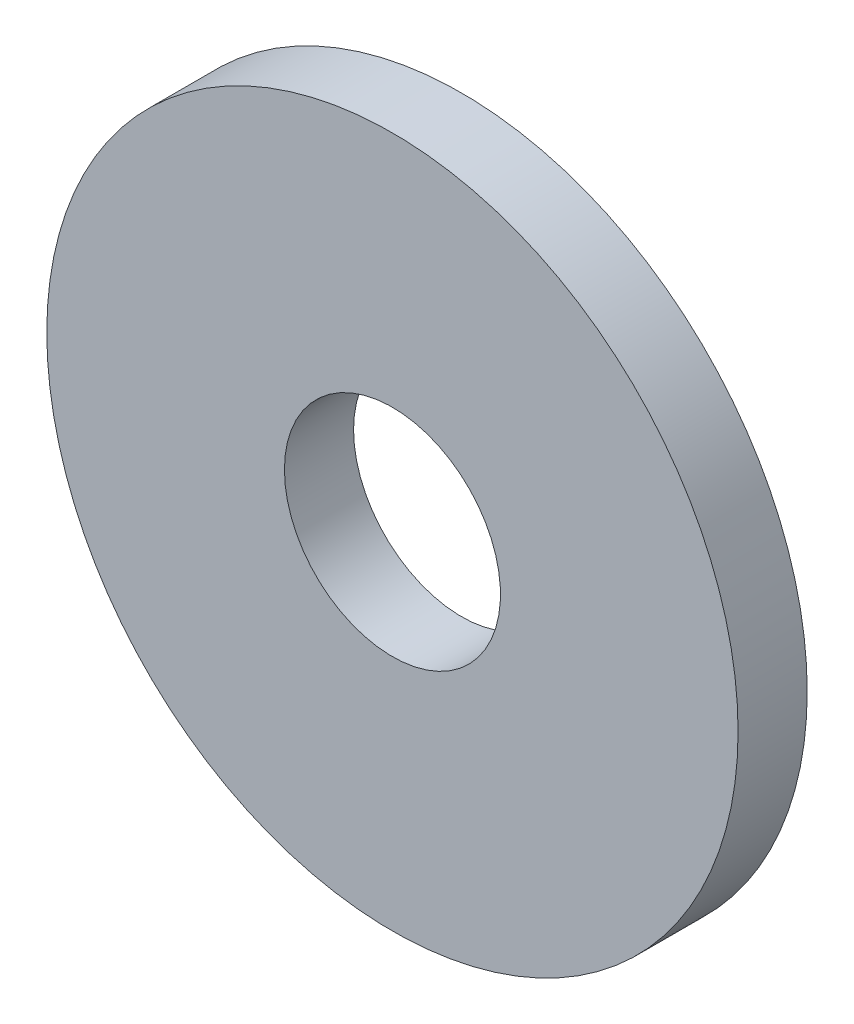
ISO-10303-21;
HEADER;
FILE_DESCRIPTION(('STEP AP214'),'2;1');
FILE_NAME('part.step','',(''),(''),'','','');
FILE_SCHEMA(('AUTOMOTIVE_DESIGN { 1 0 10303 214 1 1 1 1 }'));
ENDSEC;
DATA;
#1=APPLICATION_CONTEXT('core data for automotive mechanical design processes');
#2=APPLICATION_PROTOCOL_DEFINITION('international standard','automotive_design',2000,#1);
#3=PRODUCT_CONTEXT('',#1,'mechanical');
#4=PRODUCT('Part','Part','',(#3));
#5=PRODUCT_RELATED_PRODUCT_CATEGORY('part','',(#4));
#6=PRODUCT_DEFINITION_FORMATION('','',#4);
#7=PRODUCT_DEFINITION_CONTEXT('part definition',#1,'design');
#8=PRODUCT_DEFINITION('design','',#6,#7);
#9=PRODUCT_DEFINITION_SHAPE('','',#8);
#10=(LENGTH_UNIT() NAMED_UNIT(*) SI_UNIT(.MILLI.,.METRE.));
#11=(NAMED_UNIT(*) PLANE_ANGLE_UNIT() SI_UNIT($,.RADIAN.));
#12=(NAMED_UNIT(*) SI_UNIT($,.STERADIAN.) SOLID_ANGLE_UNIT());
#13=UNCERTAINTY_MEASURE_WITH_UNIT(LENGTH_MEASURE(1.E-05),#10,'distance_accuracy_value','');
#14=(GEOMETRIC_REPRESENTATION_CONTEXT(3) GLOBAL_UNCERTAINTY_ASSIGNED_CONTEXT((#13)) GLOBAL_UNIT_ASSIGNED_CONTEXT((#10,
#11,#12)) REPRESENTATION_CONTEXT('',''));
#15=CARTESIAN_POINT('',(0.,0.,0.));
#16=DIRECTION('',(0.,0.,1.));
#17=DIRECTION('',(1.,0.,0.));
#18=AXIS2_PLACEMENT_3D('',#15,#16,#17);
#19=CARTESIAN_POINT('',(3.50000000000002,49.1953945374974,467.453390593276));
#20=DIRECTION('',(0.,0.,-1.));
#21=DIRECTION('',(-1.,0.,0.));
#22=AXIS2_PLACEMENT_3D('',#19,#20,#21);
#23=CYLINDRICAL_SURFACE('',#22,4.);
#24=CARTESIAN_POINT('',(3.50000000000002,49.1953945374974,467.453390593276));
#25=DIRECTION('',(0.,0.,-1.));
#26=DIRECTION('',(-1.,0.,0.));
#27=AXIS2_PLACEMENT_3D('',#24,#25,#26);
#28=CIRCLE('',#27,4.);
#29=CARTESIAN_POINT('',(-0.499999999999983,49.1953945374974,467.453390593276));
#30=VERTEX_POINT('',#29);
#31=EDGE_CURVE('E10',#30,#30,#28,.T.);
#32=ORIENTED_EDGE('',*,*,#31,.T.);
#33=EDGE_LOOP('',(#32));
#34=FACE_BOUND('',#33,.T.);
#35=CARTESIAN_POINT('',(3.50000000000002,49.1953945374974,466.653390593276));
#36=DIRECTION('',(0.,0.,-1.));
#37=DIRECTION('',(-1.,0.,0.));
#38=AXIS2_PLACEMENT_3D('',#35,#36,#37);
#39=CIRCLE('',#38,4.);
#40=CARTESIAN_POINT('',(-0.499999999999983,49.1953945374974,466.653390593276));
#41=VERTEX_POINT('',#40);
#42=EDGE_CURVE('E36',#41,#41,#39,.T.);
#43=ORIENTED_EDGE('',*,*,#42,.F.);
#44=EDGE_LOOP('',(#43));
#45=FACE_BOUND('',#44,.T.);
#46=ADVANCED_FACE('F33',(#34,#45),#23,.T.);
#47=CARTESIAN_POINT('',(3.50000000000002,49.1953945374974,467.453390593276));
#48=DIRECTION('',(0.,0.,-1.));
#49=DIRECTION('',(-1.,0.,0.));
#50=AXIS2_PLACEMENT_3D('',#47,#48,#49);
#51=PLANE('',#50);
#52=CARTESIAN_POINT('',(3.50000000000002,49.1953945374974,467.453390593276));
#53=DIRECTION('',(0.,0.,-1.));
#54=DIRECTION('',(-1.,0.,0.));
#55=AXIS2_PLACEMENT_3D('',#52,#53,#54);
#56=CIRCLE('',#55,1.25);
#57=CARTESIAN_POINT('',(2.25000000000002,49.1953945374974,467.453390593276));
#58=VERTEX_POINT('',#57);
#59=EDGE_CURVE('E43',#58,#58,#56,.T.);
#60=ORIENTED_EDGE('',*,*,#59,.T.);
#61=EDGE_LOOP('',(#60));
#62=FACE_BOUND('',#61,.T.);
#63=ORIENTED_EDGE('',*,*,#31,.F.);
#64=EDGE_LOOP('',(#63));
#65=FACE_BOUND('',#64,.T.);
#66=ADVANCED_FACE('F51',(#62,#65),#51,.F.);
#67=CARTESIAN_POINT('',(3.50000000000002,49.1953945374974,466.653390593276));
#68=DIRECTION('',(0.,0.,-1.));
#69=DIRECTION('',(-1.,0.,0.));
#70=AXIS2_PLACEMENT_3D('',#67,#68,#69);
#71=PLANE('',#70);
#72=CARTESIAN_POINT('',(3.50000000000002,49.1953945374974,466.653390593276));
#73=DIRECTION('',(0.,0.,-1.));
#74=DIRECTION('',(-1.,0.,0.));
#75=AXIS2_PLACEMENT_3D('',#72,#73,#74);
#76=CIRCLE('',#75,1.25);
#77=CARTESIAN_POINT('',(2.25000000000002,49.1953945374974,466.653390593276));
#78=VERTEX_POINT('',#77);
#79=EDGE_CURVE('E45',#78,#78,#76,.T.);
#80=ORIENTED_EDGE('',*,*,#79,.F.);
#81=EDGE_LOOP('',(#80));
#82=FACE_BOUND('',#81,.T.);
#83=ORIENTED_EDGE('',*,*,#42,.T.);
#84=EDGE_LOOP('',(#83));
#85=FACE_BOUND('',#84,.T.);
#86=ADVANCED_FACE('F57',(#82,#85),#71,.T.);
#87=CARTESIAN_POINT('',(3.50000000000002,49.1953945374974,467.453390593276));
#88=DIRECTION('',(0.,0.,-1.));
#89=DIRECTION('',(-1.,0.,0.));
#90=AXIS2_PLACEMENT_3D('',#87,#88,#89);
#91=CYLINDRICAL_SURFACE('',#90,1.25);
#92=ORIENTED_EDGE('',*,*,#59,.F.);
#93=EDGE_LOOP('',(#92));
#94=FACE_BOUND('',#93,.T.);
#95=ORIENTED_EDGE('',*,*,#79,.T.);
#96=EDGE_LOOP('',(#95));
#97=FACE_BOUND('',#96,.T.);
#98=ADVANCED_FACE('F54',(#94,#97),#91,.F.);
#99=CLOSED_SHELL('',(#46,#66,#86,#98));
#100=MANIFOLD_SOLID_BREP('B2',#99);
#101=ADVANCED_BREP_SHAPE_REPRESENTATION('',(#18,#100),#14);
#102=SHAPE_DEFINITION_REPRESENTATION(#9,#101);
ENDSEC;
END-ISO-10303-21;
